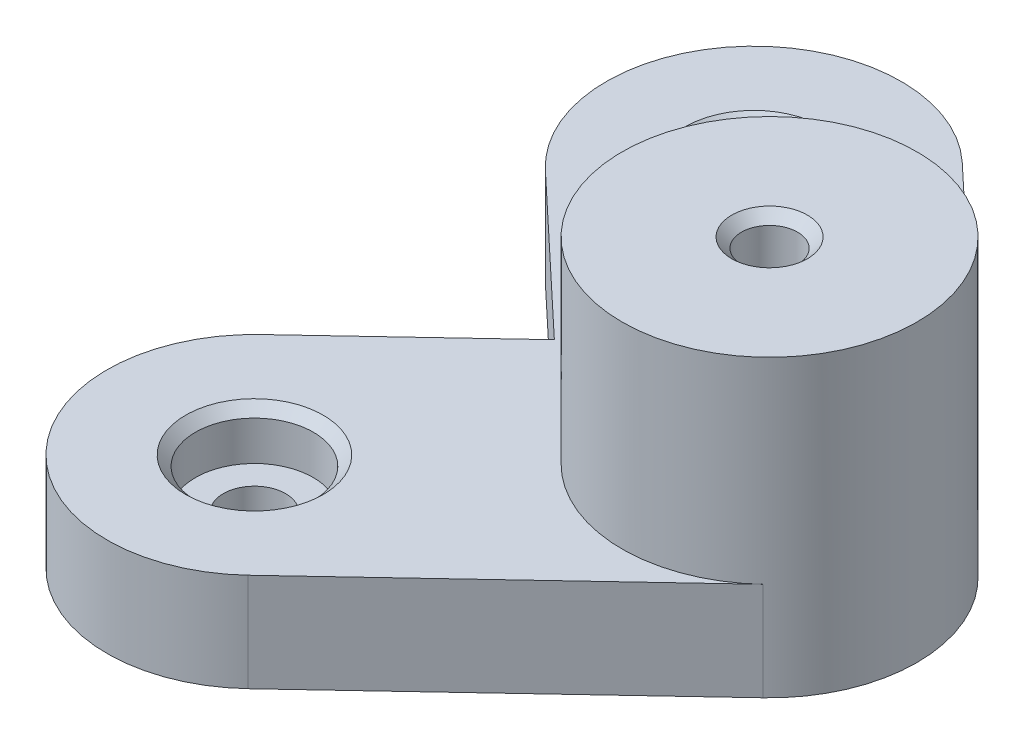
ISO-10303-21;
HEADER;
FILE_DESCRIPTION(('STEP AP214'),'2;1');
FILE_NAME('part.step','',(''),(''),'','','');
FILE_SCHEMA(('AUTOMOTIVE_DESIGN { 1 0 10303 214 1 1 1 1 }'));
ENDSEC;
DATA;
#1=APPLICATION_CONTEXT('core data for automotive mechanical design processes');
#2=APPLICATION_PROTOCOL_DEFINITION('international standard','automotive_design',2000,#1);
#3=PRODUCT_CONTEXT('',#1,'mechanical');
#4=PRODUCT('Part','Part','',(#3));
#5=PRODUCT_RELATED_PRODUCT_CATEGORY('part','',(#4));
#6=PRODUCT_DEFINITION_FORMATION('','',#4);
#7=PRODUCT_DEFINITION_CONTEXT('part definition',#1,'design');
#8=PRODUCT_DEFINITION('design','',#6,#7);
#9=PRODUCT_DEFINITION_SHAPE('','',#8);
#10=(LENGTH_UNIT() NAMED_UNIT(*) SI_UNIT(.MILLI.,.METRE.));
#11=(NAMED_UNIT(*) PLANE_ANGLE_UNIT() SI_UNIT($,.RADIAN.));
#12=(NAMED_UNIT(*) SI_UNIT($,.STERADIAN.) SOLID_ANGLE_UNIT());
#13=UNCERTAINTY_MEASURE_WITH_UNIT(LENGTH_MEASURE(1.E-05),#10,'distance_accuracy_value','');
#14=(GEOMETRIC_REPRESENTATION_CONTEXT(3) GLOBAL_UNCERTAINTY_ASSIGNED_CONTEXT((#13)) GLOBAL_UNIT_ASSIGNED_CONTEXT((#10,
#11,#12)) REPRESENTATION_CONTEXT('',''));
#15=CARTESIAN_POINT('',(0.,0.,0.));
#16=DIRECTION('',(0.,0.,1.));
#17=DIRECTION('',(1.,0.,0.));
#18=AXIS2_PLACEMENT_3D('',#15,#16,#17);
#19=CARTESIAN_POINT('',(-127.,10.,-25.4));
#20=DIRECTION('',(0.,-1.,0.));
#21=DIRECTION('',(0.,0.,-1.));
#22=AXIS2_PLACEMENT_3D('',#19,#20,#21);
#23=CYLINDRICAL_SURFACE('',#22,3.17499999999997);
#24=CARTESIAN_POINT('',(-127.,0.,-25.4));
#25=DIRECTION('',(0.,1.,0.));
#26=DIRECTION('',(0.,0.,1.));
#27=AXIS2_PLACEMENT_3D('',#24,#25,#26);
#28=CIRCLE('',#27,3.17499999999997);
#29=CARTESIAN_POINT('',(-127.,0.,-22.225));
#30=VERTEX_POINT('',#29);
#31=EDGE_CURVE('E141',#30,#30,#28,.T.);
#32=ORIENTED_EDGE('',*,*,#31,.F.);
#33=EDGE_LOOP('',(#32));
#34=FACE_BOUND('',#33,.T.);
#35=CARTESIAN_POINT('',(-127.,5.,-25.4));
#36=DIRECTION('',(0.,1.,0.));
#37=DIRECTION('',(0.,0.,1.));
#38=AXIS2_PLACEMENT_3D('',#35,#36,#37);
#39=CIRCLE('',#38,3.17499999999997);
#40=CARTESIAN_POINT('',(-127.,5.,-22.225));
#41=VERTEX_POINT('',#40);
#42=EDGE_CURVE('E167',#41,#41,#39,.T.);
#43=ORIENTED_EDGE('',*,*,#42,.T.);
#44=EDGE_LOOP('',(#43));
#45=FACE_BOUND('',#44,.T.);
#46=ADVANCED_FACE('F39',(#34,#45),#23,.F.);
#47=CARTESIAN_POINT('',(-127.,10.,25.4));
#48=DIRECTION('',(0.,-1.,0.));
#49=DIRECTION('',(0.,0.,-1.));
#50=AXIS2_PLACEMENT_3D('',#47,#48,#49);
#51=CYLINDRICAL_SURFACE('',#50,3.175);
#52=CARTESIAN_POINT('',(-127.,0.,25.4));
#53=DIRECTION('',(0.,1.,0.));
#54=DIRECTION('',(0.,0.,1.));
#55=AXIS2_PLACEMENT_3D('',#52,#53,#54);
#56=CIRCLE('',#55,3.175);
#57=CARTESIAN_POINT('',(-127.,0.,28.575));
#58=VERTEX_POINT('',#57);
#59=EDGE_CURVE('E210',#58,#58,#56,.T.);
#60=ORIENTED_EDGE('',*,*,#59,.F.);
#61=EDGE_LOOP('',(#60));
#62=FACE_BOUND('',#61,.T.);
#63=CARTESIAN_POINT('',(-127.,5.,25.4));
#64=DIRECTION('',(0.,1.,0.));
#65=DIRECTION('',(0.,0.,1.));
#66=AXIS2_PLACEMENT_3D('',#63,#64,#65);
#67=CIRCLE('',#66,3.175);
#68=CARTESIAN_POINT('',(-127.,5.,28.575));
#69=VERTEX_POINT('',#68);
#70=EDGE_CURVE('E162',#69,#69,#67,.T.);
#71=ORIENTED_EDGE('',*,*,#70,.T.);
#72=EDGE_LOOP('',(#71));
#73=FACE_BOUND('',#72,.T.);
#74=ADVANCED_FACE('F243',(#62,#73),#51,.F.);
#75=CARTESIAN_POINT('',(-127.,10.,-25.4));
#76=DIRECTION('',(0.,1.,0.));
#77=DIRECTION('',(0.,0.,1.));
#78=AXIS2_PLACEMENT_3D('',#75,#76,#77);
#79=PLANE('',#78);
#80=CARTESIAN_POINT('',(-127.,10.,25.4));
#81=DIRECTION('',(0.,1.,0.));
#82=DIRECTION('',(0.,0.,1.));
#83=AXIS2_PLACEMENT_3D('',#80,#81,#82);
#84=CIRCLE('',#83,6.99999999999999);
#85=CARTESIAN_POINT('',(-127.,10.,32.4));
#86=VERTEX_POINT('',#85);
#87=EDGE_CURVE('E49',#86,#86,#84,.F.);
#88=ORIENTED_EDGE('',*,*,#87,.T.);
#89=EDGE_LOOP('',(#88));
#90=FACE_BOUND('',#89,.T.);
#91=CARTESIAN_POINT('',(-127.,10.,-25.4));
#92=DIRECTION('',(0.,1.,0.));
#93=DIRECTION('',(0.,0.,1.));
#94=AXIS2_PLACEMENT_3D('',#91,#92,#93);
#95=CIRCLE('',#94,6.99999999999999);
#96=CARTESIAN_POINT('',(-127.,10.,-18.4));
#97=VERTEX_POINT('',#96);
#98=EDGE_CURVE('E180',#97,#97,#95,.F.);
#99=ORIENTED_EDGE('',*,*,#98,.T.);
#100=EDGE_LOOP('',(#99));
#101=FACE_BOUND('',#100,.T.);
#102=CARTESIAN_POINT('',(-100.,10.,0.));
#103=DIRECTION('',(0.,1.,0.));
#104=DIRECTION('',(0.,0.,1.));
#105=AXIS2_PLACEMENT_3D('',#102,#103,#104);
#106=CIRCLE('',#105,15.);
#107=CARTESIAN_POINT('',(-89.7220541711634,10.,-10.925375487346));
#108=VERTEX_POINT('',#107);
#109=CARTESIAN_POINT('',(-89.7220541711634,10.,10.925375487346));
#110=VERTEX_POINT('',#109);
#111=EDGE_CURVE('E161',#108,#110,#106,.T.);
#112=ORIENTED_EDGE('',*,*,#111,.F.);
#113=DIRECTION('',(-0.728358365823063,0.,-0.685196388589109));
#114=VECTOR('',#113,1.);
#115=CARTESIAN_POINT('',(-89.7220541711634,10.,-10.925375487346));
#116=LINE('',#115,#114);
#117=CARTESIAN_POINT('',(-116.722054171163,10.,-36.325375487346));
#118=VERTEX_POINT('',#117);
#119=EDGE_CURVE('E57',#108,#118,#116,.T.);
#120=ORIENTED_EDGE('',*,*,#119,.T.);
#121=CARTESIAN_POINT('',(-127.,10.,-25.4));
#122=DIRECTION('',(0.,1.,0.));
#123=DIRECTION('',(0.,0.,1.));
#124=AXIS2_PLACEMENT_3D('',#121,#122,#123);
#125=CIRCLE('',#124,15.0000000000001);
#126=CARTESIAN_POINT('',(-137.277945828837,10.,-14.4746245126541));
#127=VERTEX_POINT('',#126);
#128=EDGE_CURVE('E150',#118,#127,#125,.T.);
#129=ORIENTED_EDGE('',*,*,#128,.T.);
#130=DIRECTION('',(0.728358365823063,0.,0.685196388589108));
#131=VECTOR('',#130,1.);
#132=CARTESIAN_POINT('',(-121.891533945307,10.,0.));
#133=LINE('',#132,#131);
#134=CARTESIAN_POINT('',(-121.891533945307,10.,0.));
#135=VERTEX_POINT('',#134);
#136=EDGE_CURVE('E99',#127,#135,#133,.T.);
#137=ORIENTED_EDGE('',*,*,#136,.T.);
#138=DIRECTION('',(-0.728358365823062,0.,0.685196388589109));
#139=VECTOR('',#138,1.);
#140=CARTESIAN_POINT('',(-121.891533945307,10.,0.));
#141=LINE('',#140,#139);
#142=CARTESIAN_POINT('',(-137.277945828836,10.,14.4746245126541));
#143=VERTEX_POINT('',#142);
#144=EDGE_CURVE('E115',#135,#143,#141,.T.);
#145=ORIENTED_EDGE('',*,*,#144,.T.);
#146=CARTESIAN_POINT('',(-127.,10.,25.4));
#147=DIRECTION('',(0.,1.,0.));
#148=DIRECTION('',(0.,0.,1.));
#149=AXIS2_PLACEMENT_3D('',#146,#147,#148);
#150=CIRCLE('',#149,14.9999999999999);
#151=CARTESIAN_POINT('',(-116.722054171163,10.,36.3253754873459));
#152=VERTEX_POINT('',#151);
#153=EDGE_CURVE('E108',#143,#152,#150,.T.);
#154=ORIENTED_EDGE('',*,*,#153,.T.);
#155=DIRECTION('',(0.728358365823065,0.,-0.685196388589107));
#156=VECTOR('',#155,1.);
#157=CARTESIAN_POINT('',(-89.7220541711634,10.,10.925375487346));
#158=LINE('',#157,#156);
#159=EDGE_CURVE('E112',#152,#110,#158,.T.);
#160=ORIENTED_EDGE('',*,*,#159,.T.);
#161=EDGE_LOOP('',(#112,#120,#129,#137,#145,#154,#160));
#162=FACE_BOUND('',#161,.T.);
#163=ADVANCED_FACE('F110',(#90,#101,#162),#79,.T.);
#164=CARTESIAN_POINT('',(-127.,0.,-25.4));
#165=DIRECTION('',(0.,1.,0.));
#166=DIRECTION('',(0.,0.,1.));
#167=AXIS2_PLACEMENT_3D('',#164,#165,#166);
#168=PLANE('',#167);
#169=CARTESIAN_POINT('',(-100.,0.,0.));
#170=DIRECTION('',(0.,1.,0.));
#171=DIRECTION('',(0.,0.,1.));
#172=AXIS2_PLACEMENT_3D('',#169,#170,#171);
#173=CIRCLE('',#172,2.85);
#174=CARTESIAN_POINT('',(-100.,0.,2.85));
#175=VERTEX_POINT('',#174);
#176=EDGE_CURVE('E165',#175,#175,#173,.T.);
#177=ORIENTED_EDGE('',*,*,#176,.T.);
#178=EDGE_LOOP('',(#177));
#179=FACE_BOUND('',#178,.T.);
#180=CARTESIAN_POINT('',(-127.,0.,-25.4));
#181=DIRECTION('',(0.,1.,0.));
#182=DIRECTION('',(0.,0.,1.));
#183=AXIS2_PLACEMENT_3D('',#180,#181,#182);
#184=CIRCLE('',#183,15.0000000000001);
#185=CARTESIAN_POINT('',(-116.722054171163,0.,-36.325375487346));
#186=VERTEX_POINT('',#185);
#187=CARTESIAN_POINT('',(-137.277945828837,0.,-14.4746245126541));
#188=VERTEX_POINT('',#187);
#189=EDGE_CURVE('E137',#186,#188,#184,.T.);
#190=ORIENTED_EDGE('',*,*,#189,.F.);
#191=DIRECTION('',(-0.728358365823063,0.,-0.685196388589109));
#192=VECTOR('',#191,1.);
#193=CARTESIAN_POINT('',(-89.7220541711634,0.,-10.925375487346));
#194=LINE('',#193,#192);
#195=CARTESIAN_POINT('',(-89.7220541711634,0.,-10.925375487346));
#196=VERTEX_POINT('',#195);
#197=EDGE_CURVE('E90',#196,#186,#194,.T.);
#198=ORIENTED_EDGE('',*,*,#197,.F.);
#199=CARTESIAN_POINT('',(-100.,0.,0.));
#200=DIRECTION('',(0.,1.,0.));
#201=DIRECTION('',(0.,0.,1.));
#202=AXIS2_PLACEMENT_3D('',#199,#200,#201);
#203=CIRCLE('',#202,15.);
#204=CARTESIAN_POINT('',(-89.7220541711634,0.,10.925375487346));
#205=VERTEX_POINT('',#204);
#206=EDGE_CURVE('E84',#205,#196,#203,.T.);
#207=ORIENTED_EDGE('',*,*,#206,.F.);
#208=DIRECTION('',(0.728358365823065,0.,-0.685196388589107));
#209=VECTOR('',#208,1.);
#210=CARTESIAN_POINT('',(-89.7220541711634,0.,10.925375487346));
#211=LINE('',#210,#209);
#212=CARTESIAN_POINT('',(-116.722054171163,0.,36.3253754873459));
#213=VERTEX_POINT('',#212);
#214=EDGE_CURVE('E146',#213,#205,#211,.T.);
#215=ORIENTED_EDGE('',*,*,#214,.F.);
#216=CARTESIAN_POINT('',(-127.,0.,25.4));
#217=DIRECTION('',(0.,1.,0.));
#218=DIRECTION('',(0.,0.,1.));
#219=AXIS2_PLACEMENT_3D('',#216,#217,#218);
#220=CIRCLE('',#219,14.9999999999999);
#221=CARTESIAN_POINT('',(-137.277945828836,0.,14.4746245126541));
#222=VERTEX_POINT('',#221);
#223=EDGE_CURVE('E124',#222,#213,#220,.T.);
#224=ORIENTED_EDGE('',*,*,#223,.F.);
#225=DIRECTION('',(-0.728358365823062,0.,0.685196388589109));
#226=VECTOR('',#225,1.);
#227=CARTESIAN_POINT('',(-121.891533945307,0.,0.));
#228=LINE('',#227,#226);
#229=CARTESIAN_POINT('',(-121.891533945307,0.,0.));
#230=VERTEX_POINT('',#229);
#231=EDGE_CURVE('E143',#230,#222,#228,.T.);
#232=ORIENTED_EDGE('',*,*,#231,.F.);
#233=DIRECTION('',(0.728358365823063,0.,0.685196388589108));
#234=VECTOR('',#233,1.);
#235=CARTESIAN_POINT('',(-121.891533945307,0.,0.));
#236=LINE('',#235,#234);
#237=EDGE_CURVE('E140',#188,#230,#236,.T.);
#238=ORIENTED_EDGE('',*,*,#237,.F.);
#239=EDGE_LOOP('',(#190,#198,#207,#215,#224,#232,#238));
#240=FACE_BOUND('',#239,.T.);
#241=ORIENTED_EDGE('',*,*,#31,.T.);
#242=EDGE_LOOP('',(#241));
#243=FACE_BOUND('',#242,.T.);
#244=ORIENTED_EDGE('',*,*,#59,.T.);
#245=EDGE_LOOP('',(#244));
#246=FACE_BOUND('',#245,.T.);
#247=ADVANCED_FACE('F225',(#179,#240,#243,#246),#168,.F.);
#248=CARTESIAN_POINT('',(-127.,10.,-25.4));
#249=DIRECTION('',(0.,-1.,0.));
#250=DIRECTION('',(0.,0.,-1.));
#251=AXIS2_PLACEMENT_3D('',#248,#249,#250);
#252=CYLINDRICAL_SURFACE('',#251,15.0000000000001);
#253=ORIENTED_EDGE('',*,*,#189,.T.);
#254=DIRECTION('',(0.,-1.,0.));
#255=VECTOR('',#254,1.);
#256=CARTESIAN_POINT('',(-137.277945828837,10.,-14.4746245126541));
#257=LINE('',#256,#255);
#258=EDGE_CURVE('E159',#127,#188,#257,.T.);
#259=ORIENTED_EDGE('',*,*,#258,.F.);
#260=ORIENTED_EDGE('',*,*,#128,.F.);
#261=DIRECTION('',(0.,-1.,0.));
#262=VECTOR('',#261,1.);
#263=CARTESIAN_POINT('',(-116.722054171163,10.,-36.325375487346));
#264=LINE('',#263,#262);
#265=EDGE_CURVE('E133',#118,#186,#264,.T.);
#266=ORIENTED_EDGE('',*,*,#265,.T.);
#267=EDGE_LOOP('',(#253,#259,#260,#266));
#268=FACE_BOUND('',#267,.T.);
#269=ADVANCED_FACE('F231',(#268),#252,.T.);
#270=CARTESIAN_POINT('',(-121.891533945307,10.,0.));
#271=DIRECTION('',(0.685196388589109,0.,-0.728358365823063));
#272=DIRECTION('',(-0.728358365823063,0.,-0.685196388589109));
#273=AXIS2_PLACEMENT_3D('',#270,#271,#272);
#274=PLANE('',#273);
#275=ORIENTED_EDGE('',*,*,#237,.T.);
#276=DIRECTION('',(0.,-1.,0.));
#277=VECTOR('',#276,1.);
#278=CARTESIAN_POINT('',(-121.891533945307,10.,0.));
#279=LINE('',#278,#277);
#280=EDGE_CURVE('E156',#135,#230,#279,.T.);
#281=ORIENTED_EDGE('',*,*,#280,.F.);
#282=ORIENTED_EDGE('',*,*,#136,.F.);
#283=ORIENTED_EDGE('',*,*,#258,.T.);
#284=EDGE_LOOP('',(#275,#281,#282,#283));
#285=FACE_BOUND('',#284,.T.);
#286=ADVANCED_FACE('F219',(#285),#274,.F.);
#287=CARTESIAN_POINT('',(-121.891533945307,10.,0.));
#288=DIRECTION('',(0.685196388589109,0.,0.728358365823062));
#289=DIRECTION('',(0.728358365823062,0.,-0.685196388589109));
#290=AXIS2_PLACEMENT_3D('',#287,#288,#289);
#291=PLANE('',#290);
#292=ORIENTED_EDGE('',*,*,#231,.T.);
#293=DIRECTION('',(0.,-1.,0.));
#294=VECTOR('',#293,1.);
#295=CARTESIAN_POINT('',(-137.277945828836,10.,14.4746245126541));
#296=LINE('',#295,#294);
#297=EDGE_CURVE('E127',#143,#222,#296,.T.);
#298=ORIENTED_EDGE('',*,*,#297,.F.);
#299=ORIENTED_EDGE('',*,*,#144,.F.);
#300=ORIENTED_EDGE('',*,*,#280,.T.);
#301=EDGE_LOOP('',(#292,#298,#299,#300));
#302=FACE_BOUND('',#301,.T.);
#303=ADVANCED_FACE('F222',(#302),#291,.F.);
#304=CARTESIAN_POINT('',(-127.,10.,25.4));
#305=DIRECTION('',(0.,-1.,0.));
#306=DIRECTION('',(0.,0.,-1.));
#307=AXIS2_PLACEMENT_3D('',#304,#305,#306);
#308=CYLINDRICAL_SURFACE('',#307,14.9999999999999);
#309=ORIENTED_EDGE('',*,*,#223,.T.);
#310=DIRECTION('',(0.,-1.,0.));
#311=VECTOR('',#310,1.);
#312=CARTESIAN_POINT('',(-116.722054171163,10.,36.3253754873459));
#313=LINE('',#312,#311);
#314=EDGE_CURVE('E121',#152,#213,#313,.T.);
#315=ORIENTED_EDGE('',*,*,#314,.F.);
#316=ORIENTED_EDGE('',*,*,#153,.F.);
#317=ORIENTED_EDGE('',*,*,#297,.T.);
#318=EDGE_LOOP('',(#309,#315,#316,#317));
#319=FACE_BOUND('',#318,.T.);
#320=ADVANCED_FACE('F122',(#319),#308,.T.);
#321=CARTESIAN_POINT('',(-89.7220541711634,10.,10.925375487346));
#322=DIRECTION('',(-0.685196388589107,0.,-0.728358365823065));
#323=DIRECTION('',(-0.728358365823065,0.,0.685196388589107));
#324=AXIS2_PLACEMENT_3D('',#321,#322,#323);
#325=PLANE('',#324);
#326=ORIENTED_EDGE('',*,*,#214,.T.);
#327=DIRECTION('',(0.,-1.,0.));
#328=VECTOR('',#327,1.);
#329=CARTESIAN_POINT('',(-89.7220541711634,10.,10.925375487346));
#330=LINE('',#329,#328);
#331=EDGE_CURVE('E128',#110,#205,#330,.T.);
#332=ORIENTED_EDGE('',*,*,#331,.F.);
#333=ORIENTED_EDGE('',*,*,#159,.F.);
#334=ORIENTED_EDGE('',*,*,#314,.T.);
#335=EDGE_LOOP('',(#326,#332,#333,#334));
#336=FACE_BOUND('',#335,.T.);
#337=ADVANCED_FACE('F131',(#336),#325,.F.);
#338=CARTESIAN_POINT('',(-100.,10.,0.));
#339=DIRECTION('',(0.,-1.,0.));
#340=DIRECTION('',(0.,0.,-1.));
#341=AXIS2_PLACEMENT_3D('',#338,#339,#340);
#342=CYLINDRICAL_SURFACE('',#341,15.);
#343=ORIENTED_EDGE('',*,*,#206,.T.);
#344=DIRECTION('',(0.,-1.,0.));
#345=VECTOR('',#344,1.);
#346=CARTESIAN_POINT('',(-89.7220541711634,10.,-10.925375487346));
#347=LINE('',#346,#345);
#348=EDGE_CURVE('E152',#108,#196,#347,.T.);
#349=ORIENTED_EDGE('',*,*,#348,.F.);
#350=ORIENTED_EDGE('',*,*,#111,.T.);
#351=ORIENTED_EDGE('',*,*,#331,.T.);
#352=EDGE_LOOP('',(#343,#349,#350,#351));
#353=FACE_BOUND('',#352,.T.);
#354=CARTESIAN_POINT('',(-100.,30.,0.));
#355=DIRECTION('',(0.,1.,0.));
#356=DIRECTION('',(0.,0.,1.));
#357=AXIS2_PLACEMENT_3D('',#354,#355,#356);
#358=CIRCLE('',#357,15.);
#359=CARTESIAN_POINT('',(-100.,30.,15.));
#360=VERTEX_POINT('',#359);
#361=EDGE_CURVE('E207',#360,#360,#358,.T.);
#362=ORIENTED_EDGE('',*,*,#361,.F.);
#363=EDGE_LOOP('',(#362));
#364=FACE_BOUND('',#363,.T.);
#365=ADVANCED_FACE('F227',(#353,#364),#342,.T.);
#366=CARTESIAN_POINT('',(-89.7220541711634,10.,-10.925375487346));
#367=DIRECTION('',(-0.685196388589109,0.,0.728358365823063));
#368=DIRECTION('',(0.728358365823063,0.,0.685196388589109));
#369=AXIS2_PLACEMENT_3D('',#366,#367,#368);
#370=PLANE('',#369);
#371=ORIENTED_EDGE('',*,*,#197,.T.);
#372=ORIENTED_EDGE('',*,*,#265,.F.);
#373=ORIENTED_EDGE('',*,*,#119,.F.);
#374=ORIENTED_EDGE('',*,*,#348,.T.);
#375=EDGE_LOOP('',(#371,#372,#373,#374));
#376=FACE_BOUND('',#375,.T.);
#377=ADVANCED_FACE('F229',(#376),#370,.F.);
#378=CARTESIAN_POINT('',(-100.,30.,0.));
#379=DIRECTION('',(0.,1.,0.));
#380=DIRECTION('',(0.,0.,1.));
#381=AXIS2_PLACEMENT_3D('',#378,#379,#380);
#382=PLANE('',#381);
#383=CARTESIAN_POINT('',(-100.,30.,0.));
#384=DIRECTION('',(0.,1.,0.));
#385=DIRECTION('',(0.,0.,1.));
#386=AXIS2_PLACEMENT_3D('',#383,#384,#385);
#387=CIRCLE('',#386,3.85000000000002);
#388=CARTESIAN_POINT('',(-100.,30.,3.85000000000002));
#389=VERTEX_POINT('',#388);
#390=EDGE_CURVE('E174',#389,#389,#387,.F.);
#391=ORIENTED_EDGE('',*,*,#390,.T.);
#392=EDGE_LOOP('',(#391));
#393=FACE_BOUND('',#392,.T.);
#394=ORIENTED_EDGE('',*,*,#361,.T.);
#395=EDGE_LOOP('',(#394));
#396=FACE_BOUND('',#395,.T.);
#397=ADVANCED_FACE('F259',(#393,#396),#382,.T.);
#398=CARTESIAN_POINT('',(-100.,-8.00000000000001,0.));
#399=DIRECTION('',(0.,1.,0.));
#400=DIRECTION('',(0.,0.,1.));
#401=AXIS2_PLACEMENT_3D('',#398,#399,#400);
#402=CYLINDRICAL_SURFACE('',#401,2.85);
#403=CARTESIAN_POINT('',(-100.,29.,0.));
#404=DIRECTION('',(0.,1.,0.));
#405=DIRECTION('',(0.,0.,1.));
#406=AXIS2_PLACEMENT_3D('',#403,#404,#405);
#407=CIRCLE('',#406,2.85);
#408=CARTESIAN_POINT('',(-100.,29.,2.85));
#409=VERTEX_POINT('',#408);
#410=EDGE_CURVE('E171',#409,#409,#407,.T.);
#411=ORIENTED_EDGE('',*,*,#410,.T.);
#412=EDGE_LOOP('',(#411));
#413=FACE_BOUND('',#412,.T.);
#414=ORIENTED_EDGE('',*,*,#176,.F.);
#415=EDGE_LOOP('',(#414));
#416=FACE_BOUND('',#415,.T.);
#417=ADVANCED_FACE('F197',(#413,#416),#402,.F.);
#418=CARTESIAN_POINT('',(-127.,5.,25.4));
#419=DIRECTION('',(0.,1.,0.));
#420=DIRECTION('',(0.,0.,1.));
#421=AXIS2_PLACEMENT_3D('',#418,#419,#420);
#422=CYLINDRICAL_SURFACE('',#421,6.);
#423=CARTESIAN_POINT('',(-127.,9.00000000000002,25.4));
#424=DIRECTION('',(0.,1.,0.));
#425=DIRECTION('',(0.,0.,1.));
#426=AXIS2_PLACEMENT_3D('',#423,#424,#425);
#427=CIRCLE('',#426,6.);
#428=CARTESIAN_POINT('',(-127.,9.00000000000002,31.4));
#429=VERTEX_POINT('',#428);
#430=EDGE_CURVE('E177',#429,#429,#427,.T.);
#431=ORIENTED_EDGE('',*,*,#430,.T.);
#432=EDGE_LOOP('',(#431));
#433=FACE_BOUND('',#432,.T.);
#434=CARTESIAN_POINT('',(-127.,5.,25.4));
#435=DIRECTION('',(0.,1.,0.));
#436=DIRECTION('',(0.,0.,1.));
#437=AXIS2_PLACEMENT_3D('',#434,#435,#436);
#438=CIRCLE('',#437,6.);
#439=CARTESIAN_POINT('',(-127.,5.,31.4));
#440=VERTEX_POINT('',#439);
#441=EDGE_CURVE('E166',#440,#440,#438,.T.);
#442=ORIENTED_EDGE('',*,*,#441,.F.);
#443=EDGE_LOOP('',(#442));
#444=FACE_BOUND('',#443,.T.);
#445=ADVANCED_FACE('F193',(#433,#444),#422,.F.);
#446=CARTESIAN_POINT('',(-127.,5.,25.4));
#447=DIRECTION('',(0.,1.,0.));
#448=DIRECTION('',(0.,0.,1.));
#449=AXIS2_PLACEMENT_3D('',#446,#447,#448);
#450=PLANE('',#449);
#451=ORIENTED_EDGE('',*,*,#70,.F.);
#452=EDGE_LOOP('',(#451));
#453=FACE_BOUND('',#452,.T.);
#454=ORIENTED_EDGE('',*,*,#441,.T.);
#455=EDGE_LOOP('',(#454));
#456=FACE_BOUND('',#455,.T.);
#457=ADVANCED_FACE('F196',(#453,#456),#450,.T.);
#458=CARTESIAN_POINT('',(-127.,5.,-25.4));
#459=DIRECTION('',(0.,1.,0.));
#460=DIRECTION('',(0.,0.,1.));
#461=AXIS2_PLACEMENT_3D('',#458,#459,#460);
#462=CYLINDRICAL_SURFACE('',#461,6.);
#463=CARTESIAN_POINT('',(-127.,9.00000000000002,-25.4));
#464=DIRECTION('',(0.,1.,0.));
#465=DIRECTION('',(0.,0.,1.));
#466=AXIS2_PLACEMENT_3D('',#463,#464,#465);
#467=CIRCLE('',#466,6.);
#468=CARTESIAN_POINT('',(-127.,9.00000000000002,-19.4));
#469=VERTEX_POINT('',#468);
#470=EDGE_CURVE('E11',#469,#469,#467,.T.);
#471=ORIENTED_EDGE('',*,*,#470,.T.);
#472=EDGE_LOOP('',(#471));
#473=FACE_BOUND('',#472,.T.);
#474=CARTESIAN_POINT('',(-127.,5.,-25.4));
#475=DIRECTION('',(0.,1.,0.));
#476=DIRECTION('',(0.,0.,1.));
#477=AXIS2_PLACEMENT_3D('',#474,#475,#476);
#478=CIRCLE('',#477,6.);
#479=CARTESIAN_POINT('',(-127.,5.,-19.4));
#480=VERTEX_POINT('',#479);
#481=EDGE_CURVE('E170',#480,#480,#478,.T.);
#482=ORIENTED_EDGE('',*,*,#481,.F.);
#483=EDGE_LOOP('',(#482));
#484=FACE_BOUND('',#483,.T.);
#485=ADVANCED_FACE('F313',(#473,#484),#462,.F.);
#486=CARTESIAN_POINT('',(-127.,5.,-25.4));
#487=DIRECTION('',(0.,1.,0.));
#488=DIRECTION('',(0.,0.,1.));
#489=AXIS2_PLACEMENT_3D('',#486,#487,#488);
#490=PLANE('',#489);
#491=ORIENTED_EDGE('',*,*,#42,.F.);
#492=EDGE_LOOP('',(#491));
#493=FACE_BOUND('',#492,.T.);
#494=ORIENTED_EDGE('',*,*,#481,.T.);
#495=EDGE_LOOP('',(#494));
#496=FACE_BOUND('',#495,.T.);
#497=ADVANCED_FACE('F321',(#493,#496),#490,.T.);
#498=CARTESIAN_POINT('',(-100.,29.,0.));
#499=DIRECTION('',(0.,1.,0.));
#500=DIRECTION('',(0.,0.,1.));
#501=AXIS2_PLACEMENT_3D('',#498,#499,#500);
#502=CONICAL_SURFACE('',#501,2.85,0.78539816339745);
#503=ORIENTED_EDGE('',*,*,#390,.F.);
#504=EDGE_LOOP('',(#503));
#505=FACE_BOUND('',#504,.T.);
#506=ORIENTED_EDGE('',*,*,#410,.F.);
#507=EDGE_LOOP('',(#506));
#508=FACE_BOUND('',#507,.T.);
#509=ADVANCED_FACE('F190',(#505,#508),#502,.F.);
#510=CARTESIAN_POINT('',(-127.,9.00000000000002,25.4));
#511=DIRECTION('',(0.,1.,0.));
#512=DIRECTION('',(0.,0.,1.));
#513=AXIS2_PLACEMENT_3D('',#510,#511,#512);
#514=CONICAL_SURFACE('',#513,6.,0.785398163397451);
#515=ORIENTED_EDGE('',*,*,#87,.F.);
#516=EDGE_LOOP('',(#515));
#517=FACE_BOUND('',#516,.T.);
#518=ORIENTED_EDGE('',*,*,#430,.F.);
#519=EDGE_LOOP('',(#518));
#520=FACE_BOUND('',#519,.T.);
#521=ADVANCED_FACE('F187',(#517,#520),#514,.F.);
#522=CARTESIAN_POINT('',(-127.,9.00000000000002,-25.4));
#523=DIRECTION('',(0.,1.,0.));
#524=DIRECTION('',(0.,0.,1.));
#525=AXIS2_PLACEMENT_3D('',#522,#523,#524);
#526=CONICAL_SURFACE('',#525,6.,0.785398163397451);
#527=ORIENTED_EDGE('',*,*,#98,.F.);
#528=EDGE_LOOP('',(#527));
#529=FACE_BOUND('',#528,.T.);
#530=ORIENTED_EDGE('',*,*,#470,.F.);
#531=EDGE_LOOP('',(#530));
#532=FACE_BOUND('',#531,.T.);
#533=ADVANCED_FACE('F42',(#529,#532),#526,.F.);
#534=CLOSED_SHELL('',(#46,#74,#163,#247,#269,#286,#303,#320,#337,#365,#377,#397,#417,#445,#457,
#485,#497,#509,#521,#533));
#535=MANIFOLD_SOLID_BREP('B2',#534);
#536=ADVANCED_BREP_SHAPE_REPRESENTATION('',(#18,#535),#14);
#537=SHAPE_DEFINITION_REPRESENTATION(#9,#536);
ENDSEC;
END-ISO-10303-21;
